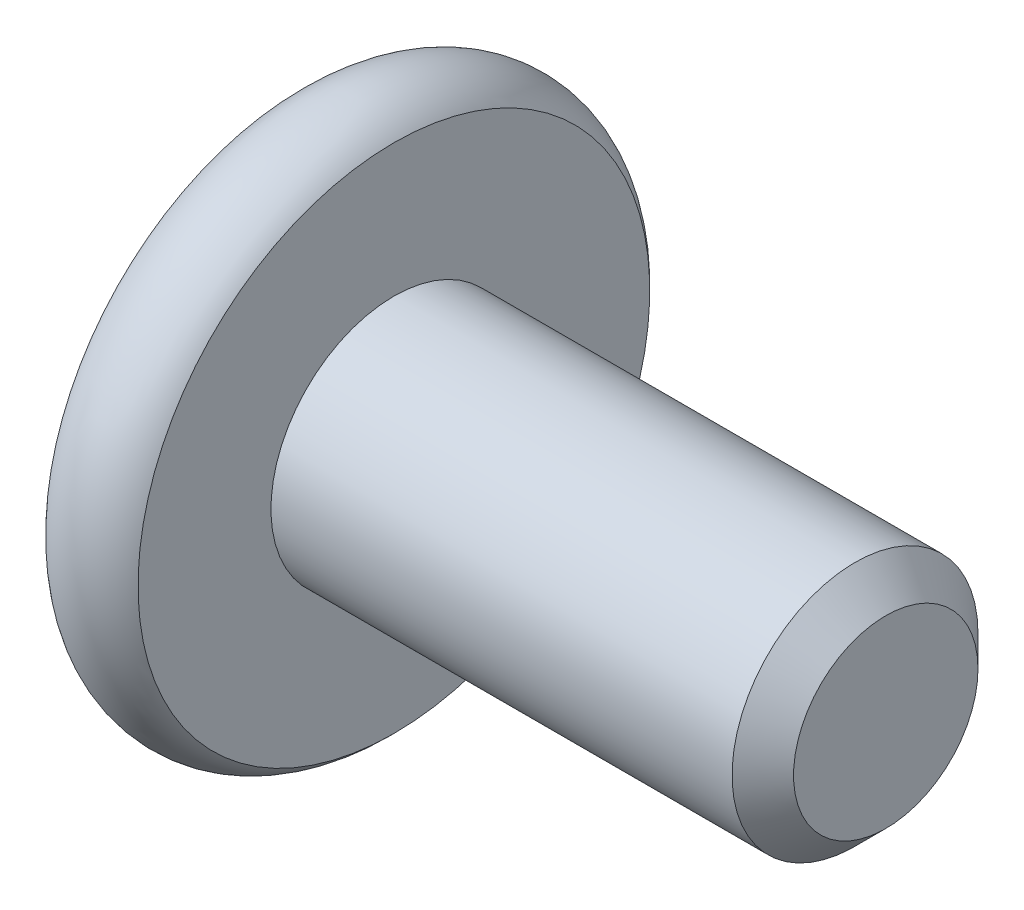
ISO-10303-21;
HEADER;
FILE_DESCRIPTION(('STEP AP214'),'2;1');
FILE_NAME('part.step','',(''),(''),'','','');
FILE_SCHEMA(('AUTOMOTIVE_DESIGN { 1 0 10303 214 1 1 1 1 }'));
ENDSEC;
DATA;
#1=APPLICATION_CONTEXT('core data for automotive mechanical design processes');
#2=APPLICATION_PROTOCOL_DEFINITION('international standard','automotive_design',2000,#1);
#3=PRODUCT_CONTEXT('',#1,'mechanical');
#4=PRODUCT('Part','Part','',(#3));
#5=PRODUCT_RELATED_PRODUCT_CATEGORY('part','',(#4));
#6=PRODUCT_DEFINITION_FORMATION('','',#4);
#7=PRODUCT_DEFINITION_CONTEXT('part definition',#1,'design');
#8=PRODUCT_DEFINITION('design','',#6,#7);
#9=PRODUCT_DEFINITION_SHAPE('','',#8);
#10=(LENGTH_UNIT() NAMED_UNIT(*) SI_UNIT(.MILLI.,.METRE.));
#11=(NAMED_UNIT(*) PLANE_ANGLE_UNIT() SI_UNIT($,.RADIAN.));
#12=(NAMED_UNIT(*) SI_UNIT($,.STERADIAN.) SOLID_ANGLE_UNIT());
#13=UNCERTAINTY_MEASURE_WITH_UNIT(LENGTH_MEASURE(1.E-05),#10,'distance_accuracy_value','');
#14=(GEOMETRIC_REPRESENTATION_CONTEXT(3) GLOBAL_UNCERTAINTY_ASSIGNED_CONTEXT((#13)) GLOBAL_UNIT_ASSIGNED_CONTEXT((#10,
#11,#12)) REPRESENTATION_CONTEXT('',''));
#15=CARTESIAN_POINT('',(0.,0.,0.));
#16=DIRECTION('',(0.,0.,1.));
#17=DIRECTION('',(1.,0.,0.));
#18=AXIS2_PLACEMENT_3D('',#15,#16,#17);
#19=CARTESIAN_POINT('',(-8.,0.,0.));
#20=DIRECTION('',(1.,0.,0.));
#21=DIRECTION('',(0.,0.,-1.));
#22=AXIS2_PLACEMENT_3D('',#19,#20,#21);
#23=CYLINDRICAL_SURFACE('',#22,2.);
#24=CARTESIAN_POINT('',(-0.500000000000002,0.,0.));
#25=DIRECTION('',(1.,0.,0.));
#26=DIRECTION('',(0.,0.,-1.));
#27=AXIS2_PLACEMENT_3D('',#24,#25,#26);
#28=CIRCLE('',#27,2.);
#29=CARTESIAN_POINT('',(-0.500000000000002,0.,-2.));
#30=VERTEX_POINT('',#29);
#31=EDGE_CURVE('E48',#30,#30,#28,.F.);
#32=ORIENTED_EDGE('',*,*,#31,.T.);
#33=EDGE_LOOP('',(#32));
#34=FACE_BOUND('',#33,.T.);
#35=CARTESIAN_POINT('',(-8.,0.,0.));
#36=DIRECTION('',(1.,0.,0.));
#37=DIRECTION('',(0.,1.,0.));
#38=AXIS2_PLACEMENT_3D('',#35,#36,#37);
#39=CIRCLE('',#38,2.);
#40=CARTESIAN_POINT('',(-8.,1.99999999999999,0.));
#41=VERTEX_POINT('',#40);
#42=EDGE_CURVE('E133',#41,#41,#39,.F.);
#43=ORIENTED_EDGE('',*,*,#42,.F.);
#44=EDGE_LOOP('',(#43));
#45=FACE_BOUND('',#44,.T.);
#46=ADVANCED_FACE('F34',(#34,#45),#23,.T.);
#47=CARTESIAN_POINT('',(0.,0.,0.));
#48=DIRECTION('',(1.,0.,0.));
#49=DIRECTION('',(0.,0.,-1.));
#50=AXIS2_PLACEMENT_3D('',#47,#48,#49);
#51=PLANE('',#50);
#52=CARTESIAN_POINT('',(0.,0.,0.));
#53=DIRECTION('',(1.,0.,0.));
#54=DIRECTION('',(0.,0.,-1.));
#55=AXIS2_PLACEMENT_3D('',#52,#53,#54);
#56=CIRCLE('',#55,1.5);
#57=CARTESIAN_POINT('',(0.,0.,-1.5));
#58=VERTEX_POINT('',#57);
#59=EDGE_CURVE('E137',#58,#58,#56,.T.);
#60=ORIENTED_EDGE('',*,*,#59,.T.);
#61=EDGE_LOOP('',(#60));
#62=FACE_BOUND('',#61,.T.);
#63=ADVANCED_FACE('F151',(#62),#51,.T.);
#64=CARTESIAN_POINT('',(0.,0.,0.));
#65=DIRECTION('',(-1.,0.,0.));
#66=DIRECTION('',(0.,0.,1.));
#67=AXIS2_PLACEMENT_3D('',#64,#65,#66);
#68=CONICAL_SURFACE('',#67,1.5,0.785398163397445);
#69=ORIENTED_EDGE('',*,*,#31,.F.);
#70=EDGE_LOOP('',(#69));
#71=FACE_BOUND('',#70,.T.);
#72=ORIENTED_EDGE('',*,*,#59,.F.);
#73=EDGE_LOOP('',(#72));
#74=FACE_BOUND('',#73,.T.);
#75=ADVANCED_FACE('F36',(#71,#74),#68,.T.);
#76=CARTESIAN_POINT('',(-9.5,0.,0.));
#77=DIRECTION('',(-1.,0.,0.));
#78=DIRECTION('',(0.,-1.,0.));
#79=AXIS2_PLACEMENT_3D('',#76,#77,#78);
#80=PLANE('',#79);
#81=CARTESIAN_POINT('',(-9.5,0.,0.));
#82=DIRECTION('',(-1.,0.,0.));
#83=DIRECTION('',(0.,-1.,0.));
#84=AXIS2_PLACEMENT_3D('',#81,#82,#83);
#85=CIRCLE('',#84,1.78205080756887);
#86=CARTESIAN_POINT('',(-9.50000000000001,-1.78205080756883,0.));
#87=VERTEX_POINT('',#86);
#88=EDGE_CURVE('E375',#87,#87,#85,.T.);
#89=ORIENTED_EDGE('',*,*,#88,.F.);
#90=EDGE_LOOP('',(#89));
#91=FACE_BOUND('',#90,.T.);
#92=CARTESIAN_POINT('',(-9.5,0.,0.));
#93=DIRECTION('',(1.,0.,0.));
#94=DIRECTION('',(0.,1.,0.));
#95=AXIS2_PLACEMENT_3D('',#92,#93,#94);
#96=CIRCLE('',#95,4.16143782776615);
#97=CARTESIAN_POINT('',(-9.5,4.16143782776615,0.));
#98=VERTEX_POINT('',#97);
#99=EDGE_CURVE('E129',#98,#98,#96,.T.);
#100=ORIENTED_EDGE('',*,*,#99,.F.);
#101=EDGE_LOOP('',(#100));
#102=FACE_BOUND('',#101,.T.);
#103=ADVANCED_FACE('F150',(#91,#102),#80,.T.);
#104=CARTESIAN_POINT('',(-8.75,0.,0.));
#105=DIRECTION('',(1.,0.,0.));
#106=DIRECTION('',(0.,1.,0.));
#107=AXIS2_PLACEMENT_3D('',#104,#105,#106);
#108=TOROIDAL_SURFACE('',#107,3.5,1.);
#109=ORIENTED_EDGE('',*,*,#99,.T.);
#110=EDGE_LOOP('',(#109));
#111=FACE_BOUND('',#110,.T.);
#112=CARTESIAN_POINT('',(-8.,0.,0.));
#113=DIRECTION('',(1.,0.,0.));
#114=DIRECTION('',(0.,1.,0.));
#115=AXIS2_PLACEMENT_3D('',#112,#113,#114);
#116=CIRCLE('',#115,4.16143782776615);
#117=CARTESIAN_POINT('',(-8.,4.16143782776615,0.));
#118=VERTEX_POINT('',#117);
#119=EDGE_CURVE('E125',#118,#118,#116,.T.);
#120=ORIENTED_EDGE('',*,*,#119,.F.);
#121=EDGE_LOOP('',(#120));
#122=FACE_BOUND('',#121,.T.);
#123=ADVANCED_FACE('F162',(#111,#122),#108,.T.);
#124=CARTESIAN_POINT('',(-8.,4.16143782776615,0.));
#125=DIRECTION('',(1.,0.,0.));
#126=DIRECTION('',(0.,1.,0.));
#127=AXIS2_PLACEMENT_3D('',#124,#125,#126);
#128=PLANE('',#127);
#129=ORIENTED_EDGE('',*,*,#42,.T.);
#130=EDGE_LOOP('',(#129));
#131=FACE_BOUND('',#130,.T.);
#132=ORIENTED_EDGE('',*,*,#119,.T.);
#133=EDGE_LOOP('',(#132));
#134=FACE_BOUND('',#133,.T.);
#135=ADVANCED_FACE('F166',(#131,#134),#128,.T.);
#136=CARTESIAN_POINT('',(-9.5,0.,0.));
#137=DIRECTION('',(-1.,0.,0.));
#138=DIRECTION('',(0.,-1.,0.));
#139=AXIS2_PLACEMENT_3D('',#136,#137,#138);
#140=CONICAL_SURFACE('',#139,1.78205080756887,0.78539816339745);
#141=ORIENTED_EDGE('',*,*,#88,.T.);
#142=EDGE_LOOP('',(#141));
#143=FACE_BOUND('',#142,.T.);
#144=CARTESIAN_POINT('',(-10.015428085613,-1.74023253176578,1.5));
#145=CARTESIAN_POINT('',(-9.98338110734452,-1.69791724929732,1.5));
#146=CARTESIAN_POINT('',(-9.95164446728407,-1.65536760966793,1.5));
#147=CARTESIAN_POINT('',(-9.8889203936153,-1.56970398156686,1.5));
#148=CARTESIAN_POINT('',(-9.85793314821998,-1.5265898554285,1.5));
#149=CARTESIAN_POINT('',(-9.76584616434498,-1.39562626326564,1.5));
#150=CARTESIAN_POINT('',(-9.70611451230213,-1.30679868010577,1.5));
#151=CARTESIAN_POINT('',(-9.58873428910124,-1.12044622640216,1.5));
#152=CARTESIAN_POINT('',(-9.53140827748225,-1.02271587306674,1.5));
#153=CARTESIAN_POINT('',(-9.42646321497596,-0.822357214965266,1.5));
#154=CARTESIAN_POINT('',(-9.37881142368962,-0.719746931701929,1.5));
#155=CARTESIAN_POINT('',(-9.32050998831504,-0.565852387095102,1.5));
#156=CARTESIAN_POINT('',(-9.30379905354091,-0.51687419142469,1.5));
#157=CARTESIAN_POINT('',(-9.2743077515089,-0.417723988457529,1.5));
#158=CARTESIAN_POINT('',(-9.26152765142192,-0.367551900263895,1.5));
#159=CARTESIAN_POINT('',(-9.24077842024577,-0.267158299056145,1.5));
#160=CARTESIAN_POINT('',(-9.23272606182594,-0.216954261864881,1.5));
#161=CARTESIAN_POINT('',(-9.22159163683403,-0.115994915871347,1.5));
#162=CARTESIAN_POINT('',(-9.21850868863769,-0.0652397064615641,1.5));
#163=CARTESIAN_POINT('',(-9.21754738974038,0.0344222234875319,1.5));
#164=CARTESIAN_POINT('',(-9.21947892169515,0.0833271701100658,1.5));
#165=CARTESIAN_POINT('',(-9.22801757296766,0.180724293127199,1.5));
#166=CARTESIAN_POINT('',(-9.23462514204803,0.229216429361706,1.5));
#167=CARTESIAN_POINT('',(-9.25226506264469,0.326258027696986,1.5));
#168=CARTESIAN_POINT('',(-9.26337316820097,0.374793507450007,1.5));
#169=CARTESIAN_POINT('',(-9.28941986695952,0.470802295834161,1.5));
#170=CARTESIAN_POINT('',(-9.3043581560035,0.518275688481264,1.5));
#171=CARTESIAN_POINT('',(-9.35683954571596,0.667150562065113,1.5));
#172=CARTESIAN_POINT('',(-9.40033511654417,0.766448362426832,1.5));
#173=CARTESIAN_POINT('',(-9.49705878148361,0.960384405673818,1.5));
#174=CARTESIAN_POINT('',(-9.55032172266746,1.05500437383619,1.5));
#175=CARTESIAN_POINT('',(-9.66022580104534,1.2358452032153,1.5));
#176=CARTESIAN_POINT('',(-9.7165682531046,1.32224986946548,1.5));
#177=CARTESIAN_POINT('',(-9.80367557259701,1.44954953726472,1.5));
#178=CARTESIAN_POINT('',(-9.83301999068387,1.49143368482421,1.5));
#179=CARTESIAN_POINT('',(-9.89248691829305,1.57462914783243,1.5));
#180=CARTESIAN_POINT('',(-9.92260921150072,1.61594061772578,1.5));
#181=CARTESIAN_POINT('',(-9.95305411813655,1.65701358742551,1.5));
#182=B_SPLINE_CURVE_WITH_KNOTS('',3,(#144,#145,#146,#147,#148,#149,#150,#151,#152,#153,#154,
#155,#156,#157,#158,#159,#160,#161,#162,#163,#164,#165,#166,#167,#168,#169,#170,#171,#172,#173,
#174,#175,#176,#177,#178,#179,#180,#181),.UNSPECIFIED.,.F.,.F.,(4,2,2,2,2,2,2,2,2,2,2,2,2,2,2,2,
2,2,4),(0.,0.159238974218354,0.318517535014543,0.639504781932389,0.9791378937992,
1.31760168934357,1.47272233841624,1.62785352839776,1.78016486537347,1.93244917778279,
2.07904486260298,2.22565464958333,2.37484213303399,2.5240177730404,2.84828365283776,
3.1737297566675,3.48303030530537,3.63644667013909,3.78982082222913),.UNSPECIFIED.);
#183=CARTESIAN_POINT('',(-9.45000000000002,-0.866025403784403,1.5));
#184=VERTEX_POINT('',#183);
#185=CARTESIAN_POINT('',(-9.45000000000001,0.866025403784475,1.5));
#186=VERTEX_POINT('',#185);
#187=EDGE_CURVE('E103',#184,#186,#182,.T.);
#188=ORIENTED_EDGE('',*,*,#187,.F.);
#189=CARTESIAN_POINT('',(-9.45011548160009,-1.73216627762268,-0.0002000000000008));
#190=CARTESIAN_POINT('',(-9.42036547606735,-1.70239359975911,0.0513677907370748));
#191=CARTESIAN_POINT('',(-9.39236248391033,-1.67212305186351,0.1037979176652));
#192=CARTESIAN_POINT('',(-9.34108923044016,-1.61039789003616,0.210709034055596));
#193=CARTESIAN_POINT('',(-9.31784750504439,-1.57893740312611,0.265200195814661));
#194=CARTESIAN_POINT('',(-9.27803372899224,-1.51549879897984,0.375079081357248));
#195=CARTESIAN_POINT('',(-9.26136158567092,-1.48353684526807,0.430438809095199));
#196=CARTESIAN_POINT('',(-9.23567445681812,-1.41890915196208,0.54237725747715));
#197=CARTESIAN_POINT('',(-9.22664029047888,-1.38624538781115,0.598952556553008));
#198=CARTESIAN_POINT('',(-9.21848908122687,-1.32995210095296,0.696455389516441));
#199=CARTESIAN_POINT('',(-9.21728225298923,-1.3063953331112,0.737256908280466));
#200=CARTESIAN_POINT('',(-9.21931405716228,-1.2593233529019,0.818787969615858));
#201=CARTESIAN_POINT('',(-9.22255367074832,-1.2358081508531,0.85951749431463));
#202=CARTESIAN_POINT('',(-9.23329198598198,-1.18900414978423,0.940584402163416));
#203=CARTESIAN_POINT('',(-9.24079465301875,-1.16571558211716,0.980921384598288));
#204=CARTESIAN_POINT('',(-9.25965161192831,-1.11952932016332,1.06091833691403));
#205=CARTESIAN_POINT('',(-9.2710075570186,-1.09663179808783,1.10057800851621));
#206=CARTESIAN_POINT('',(-9.30472164759269,-1.03798159809695,1.20216313477448));
#207=CARTESIAN_POINT('',(-9.32962184909338,-1.00259267147462,1.26345855370969));
#208=CARTESIAN_POINT('',(-9.37165665327159,-0.950557780604339,1.35358562846331));
#209=CARTESIAN_POINT('',(-9.38642515355911,-0.933410759677112,1.38328513990772));
#210=CARTESIAN_POINT('',(-9.41731056594019,-0.899432101996371,1.44213790138375));
#211=CARTESIAN_POINT('',(-9.43342683412173,-0.882600319285675,1.47129140422064));
#212=CARTESIAN_POINT('',(-9.45011548160009,-0.865909933730565,1.5002));
#213=B_SPLINE_CURVE_WITH_KNOTS('',3,(#189,#190,#191,#192,#193,#194,#195,#196,#197,#198,#199,
#200,#201,#202,#203,#204,#205,#206,#207,#208,#209,#210,#211,#212),.UNSPECIFIED.,.F.,.F.,(4,2,2,
2,2,2,2,2,2,2,2,4),(0.,0.199829143693305,0.400822987382389,0.598623720538181,0.795926240188889,
0.937113067959881,1.07833105577193,1.21968061668222,1.36109089931054,1.58570969637565,
1.69770705470964,1.80965120737194),.UNSPECIFIED.);
#214=CARTESIAN_POINT('',(-9.45000000000002,-1.73205080756884,0.));
#215=VERTEX_POINT('',#214);
#216=EDGE_CURVE('E208',#215,#184,#213,.T.);
#217=ORIENTED_EDGE('',*,*,#216,.F.);
#218=CARTESIAN_POINT('',(-9.45011548160009,-0.865909933730564,-1.5002));
#219=CARTESIAN_POINT('',(-9.42036547606734,-0.895682611594129,-1.44863220926292));
#220=CARTESIAN_POINT('',(-9.39236248391033,-0.925953159489729,-1.3962020823348));
#221=CARTESIAN_POINT('',(-9.34108923044016,-0.987678321317088,-1.2892909659444));
#222=CARTESIAN_POINT('',(-9.31784750504439,-1.01913880822714,-1.23479980418534));
#223=CARTESIAN_POINT('',(-9.27803372899224,-1.08257741237341,-1.12492091864275));
#224=CARTESIAN_POINT('',(-9.26136158567091,-1.11453936608518,-1.0695611909048));
#225=CARTESIAN_POINT('',(-9.23567445681812,-1.17916705939117,-0.95762274252285));
#226=CARTESIAN_POINT('',(-9.22664029047888,-1.2118308235421,-0.901047443446992));
#227=CARTESIAN_POINT('',(-9.21848908122687,-1.26812411040029,-0.80354461048356));
#228=CARTESIAN_POINT('',(-9.21728225298923,-1.29168087824204,-0.762743091719535));
#229=CARTESIAN_POINT('',(-9.21931405716228,-1.33875285845135,-0.681212030384143));
#230=CARTESIAN_POINT('',(-9.22255367074832,-1.36226806050015,-0.640482505685371));
#231=CARTESIAN_POINT('',(-9.23329198598198,-1.40907206156901,-0.559415597836585));
#232=CARTESIAN_POINT('',(-9.24079465301875,-1.43236062923608,-0.519078615401713));
#233=CARTESIAN_POINT('',(-9.25965161192831,-1.47854689118993,-0.43908166308597));
#234=CARTESIAN_POINT('',(-9.2710075570186,-1.50144441326542,-0.399421991483793));
#235=CARTESIAN_POINT('',(-9.30472164759269,-1.5600946132563,-0.297836865225517));
#236=CARTESIAN_POINT('',(-9.32962184909339,-1.59548353987863,-0.236541446290313));
#237=CARTESIAN_POINT('',(-9.37165665327159,-1.6475184307489,-0.146414371536688));
#238=CARTESIAN_POINT('',(-9.38642515355911,-1.66466545167613,-0.116714860092284));
#239=CARTESIAN_POINT('',(-9.41731056594019,-1.69864410935687,-0.0578620986162505));
#240=CARTESIAN_POINT('',(-9.43342683412173,-1.71547589206757,-0.0287085957793642));
#241=CARTESIAN_POINT('',(-9.45011548160009,-1.73216627762268,0.000199999999998753));
#242=B_SPLINE_CURVE_WITH_KNOTS('',3,(#218,#219,#220,#221,#222,#223,#224,#225,#226,#227,#228,
#229,#230,#231,#232,#233,#234,#235,#236,#237,#238,#239,#240,#241),.UNSPECIFIED.,.F.,.F.,(4,2,2,
2,2,2,2,2,2,2,2,4),(0.,0.199829143693305,0.400822987382389,0.59862372053818,0.795926240188888,
0.93711306795988,1.07833105577193,1.21968061668222,1.36109089931054,1.58570969637565,
1.69770705470963,1.80965120737194),.UNSPECIFIED.);
#243=CARTESIAN_POINT('',(-9.45000000000002,-0.866025403784402,-1.5));
#244=VERTEX_POINT('',#243);
#245=EDGE_CURVE('E203',#244,#215,#242,.T.);
#246=ORIENTED_EDGE('',*,*,#245,.F.);
#247=CARTESIAN_POINT('',(-10.0154280857208,-1.74023253190811,-1.5));
#248=CARTESIAN_POINT('',(-9.98338110744817,-1.69791724943563,-1.5));
#249=CARTESIAN_POINT('',(-9.95164446738357,-1.65536760980222,-1.5));
#250=CARTESIAN_POINT('',(-9.88892039370652,-1.56970398169306,-1.5));
#251=CARTESIAN_POINT('',(-9.85793314830708,-1.52658985555063,-1.5));
#252=CARTESIAN_POINT('',(-9.76584616441963,-1.39562626337533,-1.5));
#253=CARTESIAN_POINT('',(-9.70611451236851,-1.30679868020699,-1.5));
#254=CARTESIAN_POINT('',(-9.58873428915059,-1.12044622648493,-1.5));
#255=CARTESIAN_POINT('',(-9.53140827752292,-1.02271587313946,-1.5));
#256=CARTESIAN_POINT('',(-9.42646321500052,-0.822357215017053,-1.5));
#257=CARTESIAN_POINT('',(-9.37881142370675,-0.719746931742828,-1.5));
#258=CARTESIAN_POINT('',(-9.32050998832669,-0.565852387127819,-1.5));
#259=CARTESIAN_POINT('',(-9.30379905355281,-0.516874191460854,-1.5));
#260=CARTESIAN_POINT('',(-9.2743077515206,-0.417723988500702,-1.5));
#261=CARTESIAN_POINT('',(-9.26152765143317,-0.367551900310631,-1.5));
#262=CARTESIAN_POINT('',(-9.24077842025532,-0.267158299109891,-1.5));
#263=CARTESIAN_POINT('',(-9.23272606183424,-0.216954261922072,-1.5));
#264=CARTESIAN_POINT('',(-9.22159163683908,-0.115994915935317,-1.5));
#265=CARTESIAN_POINT('',(-9.21850868864073,-0.0652397065288679,-1.5));
#266=CARTESIAN_POINT('',(-9.21754738973879,0.0344222234141592,-1.5));
#267=CARTESIAN_POINT('',(-9.21947892169101,0.0833271700339495,-1.5));
#268=CARTESIAN_POINT('',(-9.22801757295801,0.180724293045874,-1.5));
#269=CARTESIAN_POINT('',(-9.23462514203542,0.229216429277917,-1.5));
#270=CARTESIAN_POINT('',(-9.2522650626259,0.326258027608332,-1.5));
#271=CARTESIAN_POINT('',(-9.26337316817893,0.37479350735896,-1.5));
#272=CARTESIAN_POINT('',(-9.28941986693092,0.470802295738563,-1.5));
#273=CARTESIAN_POINT('',(-9.30435815597158,0.518275688383507,-1.5));
#274=CARTESIAN_POINT('',(-9.35683954566847,0.66715056194616,-1.5));
#275=CARTESIAN_POINT('',(-9.40033511648235,0.766448362289903,-1.5));
#276=CARTESIAN_POINT('',(-9.49705878139157,0.960384405502318,-1.5));
#277=CARTESIAN_POINT('',(-9.5503217225595,1.0550043736481,-1.5));
#278=CARTESIAN_POINT('',(-9.66022580090691,1.2358452029974,-1.5));
#279=CARTESIAN_POINT('',(-9.71656825295176,1.32224986923425,-1.5));
#280=CARTESIAN_POINT('',(-9.80367557242264,1.44954953701377,-1.5));
#281=CARTESIAN_POINT('',(-9.83301999050238,1.49143368456679,-1.5));
#282=CARTESIAN_POINT('',(-9.89248691809732,1.57462914756209,-1.5));
#283=CARTESIAN_POINT('',(-9.92260921129788,1.615940617449,-1.5));
#284=CARTESIAN_POINT('',(-9.9530541179266,1.65701358714232,-1.5));
#285=B_SPLINE_CURVE_WITH_KNOTS('',3,(#247,#248,#249,#250,#251,#252,#253,#254,#255,#256,#257,
#258,#259,#260,#261,#262,#263,#264,#265,#266,#267,#268,#269,#270,#271,#272,#273,#274,#275,#276,
#277,#278,#279,#280,#281,#282,#283,#284),.UNSPECIFIED.,.F.,.F.,(4,2,2,2,2,2,2,2,2,2,2,2,2,2,2,2,
2,2,4),(0.,0.159238974235479,0.318517535048799,0.639504782001543,0.979137893907513,
1.31760168949067,1.47272233855335,1.62785352852489,1.78016486549104,1.93244917789081,
2.0790448627025,2.22565464967435,2.37484213311585,2.52401777311309,2.8482836528441,
3.17372975660706,3.48303030518781,3.63644666999335,3.78982082205522),.UNSPECIFIED.);
#286=CARTESIAN_POINT('',(-9.45000000000001,0.866025403784475,-1.5));
#287=VERTEX_POINT('',#286);
#288=EDGE_CURVE('E55',#287,#244,#285,.F.);
#289=ORIENTED_EDGE('',*,*,#288,.F.);
#290=CARTESIAN_POINT('',(-9.45011548160008,1.73216627762275,0.000200000000000434));
#291=CARTESIAN_POINT('',(-9.42036547606733,1.70239359975919,-0.0513677907370751));
#292=CARTESIAN_POINT('',(-9.39236248391032,1.67212305186359,-0.1037979176652));
#293=CARTESIAN_POINT('',(-9.34108923044015,1.61039789003623,-0.210709034055596));
#294=CARTESIAN_POINT('',(-9.31784750504438,1.57893740312618,-0.265200195814661));
#295=CARTESIAN_POINT('',(-9.27803372899223,1.51549879897991,-0.375079081357249));
#296=CARTESIAN_POINT('',(-9.2613615856709,1.48353684526814,-0.4304388090952));
#297=CARTESIAN_POINT('',(-9.23567445681811,1.41890915196215,-0.542377257477151));
#298=CARTESIAN_POINT('',(-9.22664029047887,1.38624538781122,-0.598952556553009));
#299=CARTESIAN_POINT('',(-9.21848908122686,1.32995210095303,-0.696455389516441));
#300=CARTESIAN_POINT('',(-9.21728225298922,1.30639533311127,-0.737256908280467));
#301=CARTESIAN_POINT('',(-9.21931405716228,1.25932335290197,-0.818787969615859));
#302=CARTESIAN_POINT('',(-9.22255367074832,1.23580815085317,-0.859517494314631));
#303=CARTESIAN_POINT('',(-9.23329198598197,1.1890041497843,-0.940584402163417));
#304=CARTESIAN_POINT('',(-9.24079465301874,1.16571558211723,-0.980921384598289));
#305=CARTESIAN_POINT('',(-9.2596516119283,1.11952932016339,-1.06091833691403));
#306=CARTESIAN_POINT('',(-9.27100755701859,1.0966317980879,-1.10057800851621));
#307=CARTESIAN_POINT('',(-9.30472164759268,1.03798159809702,-1.20216313477449));
#308=CARTESIAN_POINT('',(-9.32962184909338,1.00259267147469,-1.26345855370969));
#309=CARTESIAN_POINT('',(-9.37165665327159,0.950557780604411,-1.35358562846331));
#310=CARTESIAN_POINT('',(-9.38642515355911,0.933410759677184,-1.38328513990772));
#311=CARTESIAN_POINT('',(-9.41731056594018,0.899432101996443,-1.44213790138375));
#312=CARTESIAN_POINT('',(-9.43342683412172,0.882600319285746,-1.47129140422064));
#313=CARTESIAN_POINT('',(-9.45011548160008,0.865909933730638,-1.5002));
#314=B_SPLINE_CURVE_WITH_KNOTS('',3,(#290,#291,#292,#293,#294,#295,#296,#297,#298,#299,#300,
#301,#302,#303,#304,#305,#306,#307,#308,#309,#310,#311,#312,#313),.UNSPECIFIED.,.F.,.F.,(4,2,2,
2,2,2,2,2,2,2,2,4),(0.,0.199829143693305,0.40082298738239,0.598623720538181,0.79592624018889,
0.937113067959882,1.07833105577193,1.21968061668222,1.36109089931055,1.58570969637565,
1.69770705470964,1.80965120737194),.UNSPECIFIED.);
#315=CARTESIAN_POINT('',(-9.45000000000001,1.73205080756891,0.));
#316=VERTEX_POINT('',#315);
#317=EDGE_CURVE('E11',#316,#287,#314,.T.);
#318=ORIENTED_EDGE('',*,*,#317,.F.);
#319=CARTESIAN_POINT('',(-9.45011548160008,0.865909933730637,1.5002));
#320=CARTESIAN_POINT('',(-9.42036547606734,0.895682611594202,1.44863220926292));
#321=CARTESIAN_POINT('',(-9.39236248391032,0.925953159489801,1.3962020823348));
#322=CARTESIAN_POINT('',(-9.34108923044015,0.987678321317159,1.2892909659444));
#323=CARTESIAN_POINT('',(-9.31784750504438,1.01913880822721,1.23479980418534));
#324=CARTESIAN_POINT('',(-9.27803372899223,1.08257741237348,1.12492091864275));
#325=CARTESIAN_POINT('',(-9.2613615856709,1.11453936608525,1.0695611909048));
#326=CARTESIAN_POINT('',(-9.23567445681811,1.17916705939124,0.95762274252285));
#327=CARTESIAN_POINT('',(-9.22664029047887,1.21183082354217,0.901047443446993));
#328=CARTESIAN_POINT('',(-9.21848908122686,1.26812411040036,0.803544610483561));
#329=CARTESIAN_POINT('',(-9.21728225298922,1.29168087824211,0.762743091719535));
#330=CARTESIAN_POINT('',(-9.21931405716227,1.33875285845142,0.681212030384143));
#331=CARTESIAN_POINT('',(-9.22255367074831,1.36226806050022,0.640482505685372));
#332=CARTESIAN_POINT('',(-9.23329198598197,1.40907206156908,0.559415597836586));
#333=CARTESIAN_POINT('',(-9.24079465301874,1.43236062923616,0.519078615401714));
#334=CARTESIAN_POINT('',(-9.2596516119283,1.47854689119,0.439081663085971));
#335=CARTESIAN_POINT('',(-9.27100755701859,1.50144441326549,0.399421991483793));
#336=CARTESIAN_POINT('',(-9.30472164759268,1.56009461325637,0.297836865225516));
#337=CARTESIAN_POINT('',(-9.32962184909337,1.5954835398787,0.236541446290312));
#338=CARTESIAN_POINT('',(-9.37165665327158,1.64751843074898,0.146414371536687));
#339=CARTESIAN_POINT('',(-9.3864251535591,1.6646654516762,0.116714860092283));
#340=CARTESIAN_POINT('',(-9.41731056594018,1.69864410935694,0.0578620986162494));
#341=CARTESIAN_POINT('',(-9.43342683412172,1.71547589206764,0.0287085957793633));
#342=CARTESIAN_POINT('',(-9.45011548160008,1.73216627762275,-0.000199999999999442));
#343=B_SPLINE_CURVE_WITH_KNOTS('',3,(#319,#320,#321,#322,#323,#324,#325,#326,#327,#328,#329,
#330,#331,#332,#333,#334,#335,#336,#337,#338,#339,#340,#341,#342),.UNSPECIFIED.,.F.,.F.,(4,2,2,
2,2,2,2,2,2,2,2,4),(0.,0.199829143693304,0.400822987382387,0.598623720538179,0.795926240188887,
0.937113067959879,1.07833105577193,1.21968061668222,1.36109089931054,1.58570969637565,
1.69770705470963,1.80965120737194),.UNSPECIFIED.);
#344=EDGE_CURVE('E93',#186,#316,#343,.T.);
#345=ORIENTED_EDGE('',*,*,#344,.F.);
#346=EDGE_LOOP('',(#188,#217,#246,#289,#318,#345));
#347=FACE_BOUND('',#346,.T.);
#348=ADVANCED_FACE('F92',(#143,#347),#140,.F.);
#349=CARTESIAN_POINT('',(-7.2,0.,0.));
#350=DIRECTION('',(-1.,0.,0.));
#351=DIRECTION('',(0.,-1.,0.));
#352=AXIS2_PLACEMENT_3D('',#349,#350,#351);
#353=PLANE('',#352);
#354=DIRECTION('',(0.,0.5,-0.866025403784438));
#355=VECTOR('',#354,1.);
#356=CARTESIAN_POINT('',(-7.2,0.866025403784467,1.5));
#357=LINE('',#356,#355);
#358=CARTESIAN_POINT('',(-7.2,0.866025403784467,1.5));
#359=VERTEX_POINT('',#358);
#360=CARTESIAN_POINT('',(-7.19999999999999,1.7320508075689,0.));
#361=VERTEX_POINT('',#360);
#362=EDGE_CURVE('E102',#359,#361,#357,.T.);
#363=ORIENTED_EDGE('',*,*,#362,.T.);
#364=DIRECTION('',(0.,-0.5,-0.866025403784439));
#365=VECTOR('',#364,1.);
#366=CARTESIAN_POINT('',(-7.19999999999999,1.7320508075689,0.));
#367=LINE('',#366,#365);
#368=CARTESIAN_POINT('',(-7.2,0.866025403784467,-1.5));
#369=VERTEX_POINT('',#368);
#370=EDGE_CURVE('E107',#361,#369,#367,.T.);
#371=ORIENTED_EDGE('',*,*,#370,.T.);
#372=DIRECTION('',(0.,-1.,0.));
#373=VECTOR('',#372,1.);
#374=CARTESIAN_POINT('',(-7.2,0.866025403784467,-1.5));
#375=LINE('',#374,#373);
#376=CARTESIAN_POINT('',(-7.2,-0.866025403784411,-1.5));
#377=VERTEX_POINT('',#376);
#378=EDGE_CURVE('E234',#369,#377,#375,.T.);
#379=ORIENTED_EDGE('',*,*,#378,.T.);
#380=DIRECTION('',(0.,-0.5,0.866025403784439));
#381=VECTOR('',#380,1.);
#382=CARTESIAN_POINT('',(-7.2,-0.866025403784411,-1.5));
#383=LINE('',#382,#381);
#384=CARTESIAN_POINT('',(-7.20000000000001,-1.73205080756885,0.));
#385=VERTEX_POINT('',#384);
#386=EDGE_CURVE('E239',#377,#385,#383,.T.);
#387=ORIENTED_EDGE('',*,*,#386,.T.);
#388=DIRECTION('',(0.,0.5,0.866025403784439));
#389=VECTOR('',#388,1.);
#390=CARTESIAN_POINT('',(-7.20000000000001,-1.73205080756885,0.));
#391=LINE('',#390,#389);
#392=CARTESIAN_POINT('',(-7.2,-0.866025403784412,1.5));
#393=VERTEX_POINT('',#392);
#394=EDGE_CURVE('E121',#385,#393,#391,.T.);
#395=ORIENTED_EDGE('',*,*,#394,.T.);
#396=DIRECTION('',(0.,1.,0.));
#397=VECTOR('',#396,1.);
#398=CARTESIAN_POINT('',(-7.2,-0.866025403784412,1.5));
#399=LINE('',#398,#397);
#400=EDGE_CURVE('E111',#393,#359,#399,.T.);
#401=ORIENTED_EDGE('',*,*,#400,.T.);
#402=EDGE_LOOP('',(#363,#371,#379,#387,#395,#401));
#403=FACE_BOUND('',#402,.T.);
#404=ADVANCED_FACE('F190',(#403),#353,.T.);
#405=CARTESIAN_POINT('',(-7.19999999999999,1.7320508075689,0.));
#406=DIRECTION('',(0.,0.866025403784439,-0.5));
#407=DIRECTION('',(0.,0.5,0.866025403784439));
#408=AXIS2_PLACEMENT_3D('',#405,#406,#407);
#409=PLANE('',#408);
#410=DIRECTION('',(-1.,0.,0.));
#411=VECTOR('',#410,1.);
#412=CARTESIAN_POINT('',(-7.19999999999999,1.7320508075689,0.));
#413=LINE('',#412,#411);
#414=EDGE_CURVE('E99',#361,#316,#413,.T.);
#415=ORIENTED_EDGE('',*,*,#414,.T.);
#416=ORIENTED_EDGE('',*,*,#317,.T.);
#417=DIRECTION('',(-1.,0.,0.));
#418=VECTOR('',#417,1.);
#419=CARTESIAN_POINT('',(-7.2,0.866025403784467,-1.5));
#420=LINE('',#419,#418);
#421=EDGE_CURVE('E110',#369,#287,#420,.T.);
#422=ORIENTED_EDGE('',*,*,#421,.F.);
#423=ORIENTED_EDGE('',*,*,#370,.F.);
#424=EDGE_LOOP('',(#415,#416,#422,#423));
#425=FACE_BOUND('',#424,.T.);
#426=ADVANCED_FACE('F105',(#425),#409,.F.);
#427=CARTESIAN_POINT('',(-7.2,0.866025403784467,-1.5));
#428=DIRECTION('',(0.,0.,-1.));
#429=DIRECTION('',(0.,1.,0.));
#430=AXIS2_PLACEMENT_3D('',#427,#428,#429);
#431=PLANE('',#430);
#432=ORIENTED_EDGE('',*,*,#421,.T.);
#433=ORIENTED_EDGE('',*,*,#288,.T.);
#434=DIRECTION('',(-1.,0.,0.));
#435=VECTOR('',#434,1.);
#436=CARTESIAN_POINT('',(-7.2,-0.866025403784411,-1.5));
#437=LINE('',#436,#435);
#438=EDGE_CURVE('E117',#377,#244,#437,.T.);
#439=ORIENTED_EDGE('',*,*,#438,.F.);
#440=ORIENTED_EDGE('',*,*,#378,.F.);
#441=EDGE_LOOP('',(#432,#433,#439,#440));
#442=FACE_BOUND('',#441,.T.);
#443=ADVANCED_FACE('F223',(#442),#431,.F.);
#444=CARTESIAN_POINT('',(-7.2,-0.866025403784411,-1.5));
#445=DIRECTION('',(0.,-0.866025403784439,-0.5));
#446=DIRECTION('',(0.,0.5,-0.866025403784438));
#447=AXIS2_PLACEMENT_3D('',#444,#445,#446);
#448=PLANE('',#447);
#449=ORIENTED_EDGE('',*,*,#438,.T.);
#450=ORIENTED_EDGE('',*,*,#245,.T.);
#451=DIRECTION('',(-1.,0.,0.));
#452=VECTOR('',#451,1.);
#453=CARTESIAN_POINT('',(-7.20000000000001,-1.73205080756885,0.));
#454=LINE('',#453,#452);
#455=EDGE_CURVE('E255',#385,#215,#454,.T.);
#456=ORIENTED_EDGE('',*,*,#455,.F.);
#457=ORIENTED_EDGE('',*,*,#386,.F.);
#458=EDGE_LOOP('',(#449,#450,#456,#457));
#459=FACE_BOUND('',#458,.T.);
#460=ADVANCED_FACE('F218',(#459),#448,.F.);
#461=CARTESIAN_POINT('',(-7.20000000000001,-1.73205080756885,0.));
#462=DIRECTION('',(0.,-0.866025403784439,0.5));
#463=DIRECTION('',(0.,-0.5,-0.866025403784439));
#464=AXIS2_PLACEMENT_3D('',#461,#462,#463);
#465=PLANE('',#464);
#466=ORIENTED_EDGE('',*,*,#455,.T.);
#467=ORIENTED_EDGE('',*,*,#216,.T.);
#468=DIRECTION('',(-1.,0.,0.));
#469=VECTOR('',#468,1.);
#470=CARTESIAN_POINT('',(-7.2,-0.866025403784412,1.5));
#471=LINE('',#470,#469);
#472=EDGE_CURVE('E251',#393,#184,#471,.T.);
#473=ORIENTED_EDGE('',*,*,#472,.F.);
#474=ORIENTED_EDGE('',*,*,#394,.F.);
#475=EDGE_LOOP('',(#466,#467,#473,#474));
#476=FACE_BOUND('',#475,.T.);
#477=ADVANCED_FACE('F215',(#476),#465,.F.);
#478=CARTESIAN_POINT('',(-7.2,-0.866025403784412,1.5));
#479=DIRECTION('',(0.,0.,1.));
#480=DIRECTION('',(1.,0.,0.));
#481=AXIS2_PLACEMENT_3D('',#478,#479,#480);
#482=PLANE('',#481);
#483=ORIENTED_EDGE('',*,*,#472,.T.);
#484=ORIENTED_EDGE('',*,*,#187,.T.);
#485=DIRECTION('',(-1.,0.,0.));
#486=VECTOR('',#485,1.);
#487=CARTESIAN_POINT('',(-7.2,0.866025403784467,1.5));
#488=LINE('',#487,#486);
#489=EDGE_CURVE('E62',#359,#186,#488,.T.);
#490=ORIENTED_EDGE('',*,*,#489,.F.);
#491=ORIENTED_EDGE('',*,*,#400,.F.);
#492=EDGE_LOOP('',(#483,#484,#490,#491));
#493=FACE_BOUND('',#492,.T.);
#494=ADVANCED_FACE('F173',(#493),#482,.F.);
#495=CARTESIAN_POINT('',(-7.2,0.866025403784467,1.5));
#496=DIRECTION('',(0.,0.866025403784439,0.5));
#497=DIRECTION('',(0.,-0.5,0.866025403784439));
#498=AXIS2_PLACEMENT_3D('',#495,#496,#497);
#499=PLANE('',#498);
#500=ORIENTED_EDGE('',*,*,#489,.T.);
#501=ORIENTED_EDGE('',*,*,#344,.T.);
#502=ORIENTED_EDGE('',*,*,#414,.F.);
#503=ORIENTED_EDGE('',*,*,#362,.F.);
#504=EDGE_LOOP('',(#500,#501,#502,#503));
#505=FACE_BOUND('',#504,.T.);
#506=ADVANCED_FACE('F98',(#505),#499,.F.);
#507=CLOSED_SHELL('',(#46,#63,#75,#103,#123,#135,#348,#404,#426,#443,#460,#477,#494,#506));
#508=MANIFOLD_SOLID_BREP('B2',#507);
#509=ADVANCED_BREP_SHAPE_REPRESENTATION('',(#18,#508),#14);
#510=SHAPE_DEFINITION_REPRESENTATION(#9,#509);
ENDSEC;
END-ISO-10303-21;
